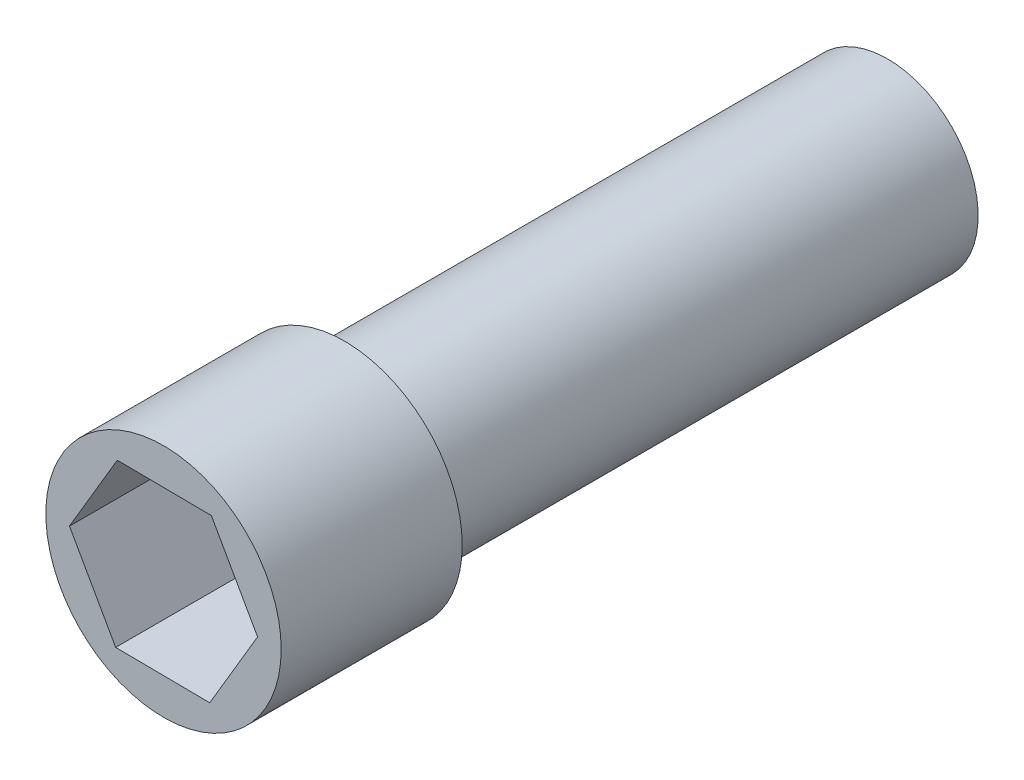
ISO-10303-21;
HEADER;
FILE_DESCRIPTION(('STEP AP214'),'2;1');
FILE_NAME('part.step','',(''),(''),'','','');
FILE_SCHEMA(('AUTOMOTIVE_DESIGN { 1 0 10303 214 1 1 1 1 }'));
ENDSEC;
DATA;
#1=APPLICATION_CONTEXT('core data for automotive mechanical design processes');
#2=APPLICATION_PROTOCOL_DEFINITION('international standard','automotive_design',2000,#1);
#3=PRODUCT_CONTEXT('',#1,'mechanical');
#4=PRODUCT('Part','Part','',(#3));
#5=PRODUCT_RELATED_PRODUCT_CATEGORY('part','',(#4));
#6=PRODUCT_DEFINITION_FORMATION('','',#4);
#7=PRODUCT_DEFINITION_CONTEXT('part definition',#1,'design');
#8=PRODUCT_DEFINITION('design','',#6,#7);
#9=PRODUCT_DEFINITION_SHAPE('','',#8);
#10=(LENGTH_UNIT() NAMED_UNIT(*) SI_UNIT(.MILLI.,.METRE.));
#11=(NAMED_UNIT(*) PLANE_ANGLE_UNIT() SI_UNIT($,.RADIAN.));
#12=(NAMED_UNIT(*) SI_UNIT($,.STERADIAN.) SOLID_ANGLE_UNIT());
#13=UNCERTAINTY_MEASURE_WITH_UNIT(LENGTH_MEASURE(1.E-05),#10,'distance_accuracy_value','');
#14=(GEOMETRIC_REPRESENTATION_CONTEXT(3) GLOBAL_UNCERTAINTY_ASSIGNED_CONTEXT((#13)) GLOBAL_UNIT_ASSIGNED_CONTEXT((#10,
#11,#12)) REPRESENTATION_CONTEXT('',''));
#15=CARTESIAN_POINT('',(0.,0.,0.));
#16=DIRECTION('',(0.,0.,1.));
#17=DIRECTION('',(1.,0.,0.));
#18=AXIS2_PLACEMENT_3D('',#15,#16,#17);
#19=CARTESIAN_POINT('',(0.,0.,-10.));
#20=DIRECTION('',(0.,0.,1.));
#21=DIRECTION('',(1.,0.,0.));
#22=AXIS2_PLACEMENT_3D('',#19,#20,#21);
#23=CYLINDRICAL_SURFACE('',#22,6.5);
#24=CARTESIAN_POINT('',(0.,0.,-10.));
#25=DIRECTION('',(0.,0.,1.));
#26=DIRECTION('',(1.,0.,0.));
#27=AXIS2_PLACEMENT_3D('',#24,#25,#26);
#28=CIRCLE('',#27,6.5);
#29=CARTESIAN_POINT('',(6.5,0.,-10.));
#30=VERTEX_POINT('',#29);
#31=EDGE_CURVE('E47',#30,#30,#28,.T.);
#32=ORIENTED_EDGE('',*,*,#31,.T.);
#33=EDGE_LOOP('',(#32));
#34=FACE_BOUND('',#33,.T.);
#35=CARTESIAN_POINT('',(0.,0.,0.));
#36=DIRECTION('',(0.,0.,1.));
#37=DIRECTION('',(1.,0.,0.));
#38=AXIS2_PLACEMENT_3D('',#35,#36,#37);
#39=CIRCLE('',#38,6.5);
#40=CARTESIAN_POINT('',(6.5,0.,0.));
#41=VERTEX_POINT('',#40);
#42=EDGE_CURVE('E42',#41,#41,#39,.T.);
#43=ORIENTED_EDGE('',*,*,#42,.F.);
#44=EDGE_LOOP('',(#43));
#45=FACE_BOUND('',#44,.T.);
#46=ADVANCED_FACE('F39',(#34,#45),#23,.T.);
#47=CARTESIAN_POINT('',(0.,0.,-10.));
#48=DIRECTION('',(0.,0.,1.));
#49=DIRECTION('',(1.,0.,0.));
#50=AXIS2_PLACEMENT_3D('',#47,#48,#49);
#51=PLANE('',#50);
#52=CARTESIAN_POINT('',(0.,0.,-10.));
#53=DIRECTION('',(0.,0.,-1.));
#54=DIRECTION('',(-1.,0.,0.));
#55=AXIS2_PLACEMENT_3D('',#52,#53,#54);
#56=CIRCLE('',#55,5.);
#57=CARTESIAN_POINT('',(-5.,0.,-10.));
#58=VERTEX_POINT('',#57);
#59=EDGE_CURVE('E11',#58,#58,#56,.T.);
#60=ORIENTED_EDGE('',*,*,#59,.F.);
#61=EDGE_LOOP('',(#60));
#62=FACE_BOUND('',#61,.T.);
#63=ORIENTED_EDGE('',*,*,#31,.F.);
#64=EDGE_LOOP('',(#63));
#65=FACE_BOUND('',#64,.T.);
#66=ADVANCED_FACE('F158',(#62,#65),#51,.F.);
#67=CARTESIAN_POINT('',(0.,0.,0.));
#68=DIRECTION('',(0.,0.,1.));
#69=DIRECTION('',(1.,0.,0.));
#70=AXIS2_PLACEMENT_3D('',#67,#68,#69);
#71=PLANE('',#70);
#72=DIRECTION('',(-0.999949634928271,0.0100363144040819,0.));
#73=VECTOR('',#72,1.);
#74=CARTESIAN_POINT('',(2.64310877387694,4.47369824747431,0.));
#75=LINE('',#74,#73);
#76=CARTESIAN_POINT('',(2.64310877387694,4.47369824747431,0.));
#77=VERTEX_POINT('',#76);
#78=CARTESIAN_POINT('',(-2.5527819442402,4.52584846688013,0.));
#79=VERTEX_POINT('',#78);
#80=EDGE_CURVE('E55',#77,#79,#75,.T.);
#81=ORIENTED_EDGE('',*,*,#80,.F.);
#82=DIRECTION('',(-0.491283114229833,0.870999943554899,0.));
#83=VECTOR('',#82,1.);
#84=CARTESIAN_POINT('',(5.19589071811715,-0.052150219405816,0.));
#85=LINE('',#84,#83);
#86=CARTESIAN_POINT('',(5.19589071811715,-0.052150219405816,0.));
#87=VERTEX_POINT('',#86);
#88=EDGE_CURVE('E138',#87,#77,#85,.T.);
#89=ORIENTED_EDGE('',*,*,#88,.F.);
#90=DIRECTION('',(0.508666520698438,0.860963629150817,0.));
#91=VECTOR('',#90,1.);
#92=CARTESIAN_POINT('',(2.55278194424021,-4.52584846688013,0.));
#93=LINE('',#92,#91);
#94=CARTESIAN_POINT('',(2.55278194424021,-4.52584846688013,0.));
#95=VERTEX_POINT('',#94);
#96=EDGE_CURVE('E136',#95,#87,#93,.T.);
#97=ORIENTED_EDGE('',*,*,#96,.F.);
#98=DIRECTION('',(0.999949634928271,-0.010036314404082,0.));
#99=VECTOR('',#98,1.);
#100=CARTESIAN_POINT('',(-2.64310877387694,-4.47369824747431,0.));
#101=LINE('',#100,#99);
#102=CARTESIAN_POINT('',(-2.64310877387694,-4.47369824747431,0.));
#103=VERTEX_POINT('',#102);
#104=EDGE_CURVE('E103',#103,#95,#101,.T.);
#105=ORIENTED_EDGE('',*,*,#104,.F.);
#106=DIRECTION('',(0.491283114229833,-0.870999943554899,0.));
#107=VECTOR('',#106,1.);
#108=CARTESIAN_POINT('',(-5.19589071811715,0.0521502194058157,0.));
#109=LINE('',#108,#107);
#110=CARTESIAN_POINT('',(-5.19589071811715,0.0521502194058157,0.));
#111=VERTEX_POINT('',#110);
#112=EDGE_CURVE('E132',#111,#103,#109,.T.);
#113=ORIENTED_EDGE('',*,*,#112,.F.);
#114=DIRECTION('',(-0.508666520698438,-0.860963629150817,0.));
#115=VECTOR('',#114,1.);
#116=CARTESIAN_POINT('',(-2.5527819442402,4.52584846688013,0.));
#117=LINE('',#116,#115);
#118=EDGE_CURVE('E129',#79,#111,#117,.T.);
#119=ORIENTED_EDGE('',*,*,#118,.F.);
#120=EDGE_LOOP('',(#81,#89,#97,#105,#113,#119));
#121=FACE_BOUND('',#120,.T.);
#122=ORIENTED_EDGE('',*,*,#42,.T.);
#123=EDGE_LOOP('',(#122));
#124=FACE_BOUND('',#123,.T.);
#125=ADVANCED_FACE('F155',(#121,#124),#71,.T.);
#126=CARTESIAN_POINT('',(0.,0.,-40.));
#127=DIRECTION('',(0.,0.,1.));
#128=DIRECTION('',(1.,0.,0.));
#129=AXIS2_PLACEMENT_3D('',#126,#127,#128);
#130=CYLINDRICAL_SURFACE('',#129,5.);
#131=CARTESIAN_POINT('',(0.,0.,-40.));
#132=DIRECTION('',(0.,0.,-1.));
#133=DIRECTION('',(-1.,0.,0.));
#134=AXIS2_PLACEMENT_3D('',#131,#132,#133);
#135=CIRCLE('',#134,5.);
#136=CARTESIAN_POINT('',(-5.,0.,-40.));
#137=VERTEX_POINT('',#136);
#138=EDGE_CURVE('E142',#137,#137,#135,.T.);
#139=ORIENTED_EDGE('',*,*,#138,.F.);
#140=EDGE_LOOP('',(#139));
#141=FACE_BOUND('',#140,.T.);
#142=ORIENTED_EDGE('',*,*,#59,.T.);
#143=EDGE_LOOP('',(#142));
#144=FACE_BOUND('',#143,.T.);
#145=ADVANCED_FACE('F167',(#141,#144),#130,.T.);
#146=CARTESIAN_POINT('',(0.,0.,-40.));
#147=DIRECTION('',(0.,0.,-1.));
#148=DIRECTION('',(-1.,0.,0.));
#149=AXIS2_PLACEMENT_3D('',#146,#147,#148);
#150=PLANE('',#149);
#151=ORIENTED_EDGE('',*,*,#138,.T.);
#152=EDGE_LOOP('',(#151));
#153=FACE_BOUND('',#152,.T.);
#154=ADVANCED_FACE('F174',(#153),#150,.T.);
#155=CARTESIAN_POINT('',(2.64310877387694,4.47369824747431,-9.));
#156=DIRECTION('',(0.0100363144040819,0.999949634928271,0.));
#157=DIRECTION('',(-0.999949634928271,0.0100363144040819,0.));
#158=AXIS2_PLACEMENT_3D('',#155,#156,#157);
#159=PLANE('',#158);
#160=ORIENTED_EDGE('',*,*,#80,.T.);
#161=DIRECTION('',(0.,0.,1.));
#162=VECTOR('',#161,1.);
#163=CARTESIAN_POINT('',(-2.5527819442402,4.52584846688013,-9.));
#164=LINE('',#163,#162);
#165=CARTESIAN_POINT('',(-2.5527819442402,4.52584846688013,-9.));
#166=VERTEX_POINT('',#165);
#167=EDGE_CURVE('E85',#166,#79,#164,.T.);
#168=ORIENTED_EDGE('',*,*,#167,.F.);
#169=DIRECTION('',(-0.999949634928271,0.0100363144040819,0.));
#170=VECTOR('',#169,1.);
#171=CARTESIAN_POINT('',(2.64310877387694,4.47369824747431,-9.));
#172=LINE('',#171,#170);
#173=CARTESIAN_POINT('',(2.64310877387694,4.47369824747431,-9.));
#174=VERTEX_POINT('',#173);
#175=EDGE_CURVE('E140',#174,#166,#172,.T.);
#176=ORIENTED_EDGE('',*,*,#175,.F.);
#177=DIRECTION('',(0.,0.,1.));
#178=VECTOR('',#177,1.);
#179=CARTESIAN_POINT('',(2.64310877387694,4.47369824747431,-9.));
#180=LINE('',#179,#178);
#181=EDGE_CURVE('E63',#174,#77,#180,.T.);
#182=ORIENTED_EDGE('',*,*,#181,.T.);
#183=EDGE_LOOP('',(#160,#168,#176,#182));
#184=FACE_BOUND('',#183,.T.);
#185=ADVANCED_FACE('F178',(#184),#159,.F.);
#186=CARTESIAN_POINT('',(5.19589071811715,-0.052150219405816,-9.));
#187=DIRECTION('',(0.870999943554899,0.491283114229833,0.));
#188=DIRECTION('',(-0.491283114229833,0.870999943554899,0.));
#189=AXIS2_PLACEMENT_3D('',#186,#187,#188);
#190=PLANE('',#189);
#191=ORIENTED_EDGE('',*,*,#88,.T.);
#192=ORIENTED_EDGE('',*,*,#181,.F.);
#193=DIRECTION('',(-0.491283114229833,0.870999943554899,0.));
#194=VECTOR('',#193,1.);
#195=CARTESIAN_POINT('',(5.19589071811715,-0.052150219405816,-9.));
#196=LINE('',#195,#194);
#197=CARTESIAN_POINT('',(5.19589071811715,-0.052150219405816,-9.));
#198=VERTEX_POINT('',#197);
#199=EDGE_CURVE('E115',#198,#174,#196,.T.);
#200=ORIENTED_EDGE('',*,*,#199,.F.);
#201=DIRECTION('',(0.,0.,1.));
#202=VECTOR('',#201,1.);
#203=CARTESIAN_POINT('',(5.19589071811715,-0.052150219405816,-9.));
#204=LINE('',#203,#202);
#205=EDGE_CURVE('E107',#198,#87,#204,.T.);
#206=ORIENTED_EDGE('',*,*,#205,.T.);
#207=EDGE_LOOP('',(#191,#192,#200,#206));
#208=FACE_BOUND('',#207,.T.);
#209=ADVANCED_FACE('F182',(#208),#190,.F.);
#210=CARTESIAN_POINT('',(2.55278194424021,-4.52584846688013,-9.));
#211=DIRECTION('',(0.860963629150817,-0.508666520698438,0.));
#212=DIRECTION('',(0.508666520698438,0.860963629150817,0.));
#213=AXIS2_PLACEMENT_3D('',#210,#211,#212);
#214=PLANE('',#213);
#215=ORIENTED_EDGE('',*,*,#96,.T.);
#216=ORIENTED_EDGE('',*,*,#205,.F.);
#217=DIRECTION('',(0.508666520698438,0.860963629150817,0.));
#218=VECTOR('',#217,1.);
#219=CARTESIAN_POINT('',(2.55278194424021,-4.52584846688013,-9.));
#220=LINE('',#219,#218);
#221=CARTESIAN_POINT('',(2.55278194424021,-4.52584846688013,-9.));
#222=VERTEX_POINT('',#221);
#223=EDGE_CURVE('E111',#222,#198,#220,.T.);
#224=ORIENTED_EDGE('',*,*,#223,.F.);
#225=DIRECTION('',(0.,0.,1.));
#226=VECTOR('',#225,1.);
#227=CARTESIAN_POINT('',(2.55278194424021,-4.52584846688013,-9.));
#228=LINE('',#227,#226);
#229=EDGE_CURVE('E96',#222,#95,#228,.T.);
#230=ORIENTED_EDGE('',*,*,#229,.T.);
#231=EDGE_LOOP('',(#215,#216,#224,#230));
#232=FACE_BOUND('',#231,.T.);
#233=ADVANCED_FACE('F112',(#232),#214,.F.);
#234=CARTESIAN_POINT('',(-2.64310877387694,-4.47369824747431,-9.));
#235=DIRECTION('',(-0.010036314404082,-0.999949634928271,0.));
#236=DIRECTION('',(0.999949634928271,-0.010036314404082,0.));
#237=AXIS2_PLACEMENT_3D('',#234,#235,#236);
#238=PLANE('',#237);
#239=ORIENTED_EDGE('',*,*,#104,.T.);
#240=ORIENTED_EDGE('',*,*,#229,.F.);
#241=DIRECTION('',(0.999949634928271,-0.010036314404082,0.));
#242=VECTOR('',#241,1.);
#243=CARTESIAN_POINT('',(-2.64310877387694,-4.47369824747431,-9.));
#244=LINE('',#243,#242);
#245=CARTESIAN_POINT('',(-2.64310877387694,-4.47369824747431,-9.));
#246=VERTEX_POINT('',#245);
#247=EDGE_CURVE('E100',#246,#222,#244,.T.);
#248=ORIENTED_EDGE('',*,*,#247,.F.);
#249=DIRECTION('',(0.,0.,1.));
#250=VECTOR('',#249,1.);
#251=CARTESIAN_POINT('',(-2.64310877387694,-4.47369824747431,-9.));
#252=LINE('',#251,#250);
#253=EDGE_CURVE('E108',#246,#103,#252,.T.);
#254=ORIENTED_EDGE('',*,*,#253,.T.);
#255=EDGE_LOOP('',(#239,#240,#248,#254));
#256=FACE_BOUND('',#255,.T.);
#257=ADVANCED_FACE('F98',(#256),#238,.F.);
#258=CARTESIAN_POINT('',(-5.19589071811715,0.0521502194058157,-9.));
#259=DIRECTION('',(-0.870999943554899,-0.491283114229833,0.));
#260=DIRECTION('',(0.491283114229833,-0.870999943554899,0.));
#261=AXIS2_PLACEMENT_3D('',#258,#259,#260);
#262=PLANE('',#261);
#263=ORIENTED_EDGE('',*,*,#112,.T.);
#264=ORIENTED_EDGE('',*,*,#253,.F.);
#265=DIRECTION('',(0.491283114229833,-0.870999943554899,0.));
#266=VECTOR('',#265,1.);
#267=CARTESIAN_POINT('',(-5.19589071811715,0.0521502194058157,-9.));
#268=LINE('',#267,#266);
#269=CARTESIAN_POINT('',(-5.19589071811715,0.0521502194058157,-9.));
#270=VERTEX_POINT('',#269);
#271=EDGE_CURVE('E121',#270,#246,#268,.T.);
#272=ORIENTED_EDGE('',*,*,#271,.F.);
#273=DIRECTION('',(0.,0.,1.));
#274=VECTOR('',#273,1.);
#275=CARTESIAN_POINT('',(-5.19589071811715,0.0521502194058157,-9.));
#276=LINE('',#275,#274);
#277=EDGE_CURVE('E145',#270,#111,#276,.T.);
#278=ORIENTED_EDGE('',*,*,#277,.T.);
#279=EDGE_LOOP('',(#263,#264,#272,#278));
#280=FACE_BOUND('',#279,.T.);
#281=ADVANCED_FACE('F186',(#280),#262,.F.);
#282=CARTESIAN_POINT('',(-2.5527819442402,4.52584846688013,-9.));
#283=DIRECTION('',(-0.860963629150817,0.508666520698438,0.));
#284=DIRECTION('',(-0.508666520698438,-0.860963629150817,0.));
#285=AXIS2_PLACEMENT_3D('',#282,#283,#284);
#286=PLANE('',#285);
#287=ORIENTED_EDGE('',*,*,#118,.T.);
#288=ORIENTED_EDGE('',*,*,#277,.F.);
#289=DIRECTION('',(-0.508666520698438,-0.860963629150817,0.));
#290=VECTOR('',#289,1.);
#291=CARTESIAN_POINT('',(-2.5527819442402,4.52584846688013,-9.));
#292=LINE('',#291,#290);
#293=EDGE_CURVE('E123',#166,#270,#292,.T.);
#294=ORIENTED_EDGE('',*,*,#293,.F.);
#295=ORIENTED_EDGE('',*,*,#167,.T.);
#296=EDGE_LOOP('',(#287,#288,#294,#295));
#297=FACE_BOUND('',#296,.T.);
#298=ADVANCED_FACE('F183',(#297),#286,.F.);
#299=CARTESIAN_POINT('',(0.,0.,-9.));
#300=DIRECTION('',(0.,0.,1.));
#301=DIRECTION('',(1.,0.,0.));
#302=AXIS2_PLACEMENT_3D('',#299,#300,#301);
#303=PLANE('',#302);
#304=ORIENTED_EDGE('',*,*,#175,.T.);
#305=ORIENTED_EDGE('',*,*,#293,.T.);
#306=ORIENTED_EDGE('',*,*,#271,.T.);
#307=ORIENTED_EDGE('',*,*,#247,.T.);
#308=ORIENTED_EDGE('',*,*,#223,.T.);
#309=ORIENTED_EDGE('',*,*,#199,.T.);
#310=EDGE_LOOP('',(#304,#305,#306,#307,#308,#309));
#311=FACE_BOUND('',#310,.T.);
#312=ADVANCED_FACE('F118',(#311),#303,.T.);
#313=CLOSED_SHELL('',(#46,#66,#125,#145,#154,#185,#209,#233,#257,#281,#298,#312));
#314=MANIFOLD_SOLID_BREP('B2',#313);
#315=ADVANCED_BREP_SHAPE_REPRESENTATION('',(#18,#314),#14);
#316=SHAPE_DEFINITION_REPRESENTATION(#9,#315);
ENDSEC;
END-ISO-10303-21;
